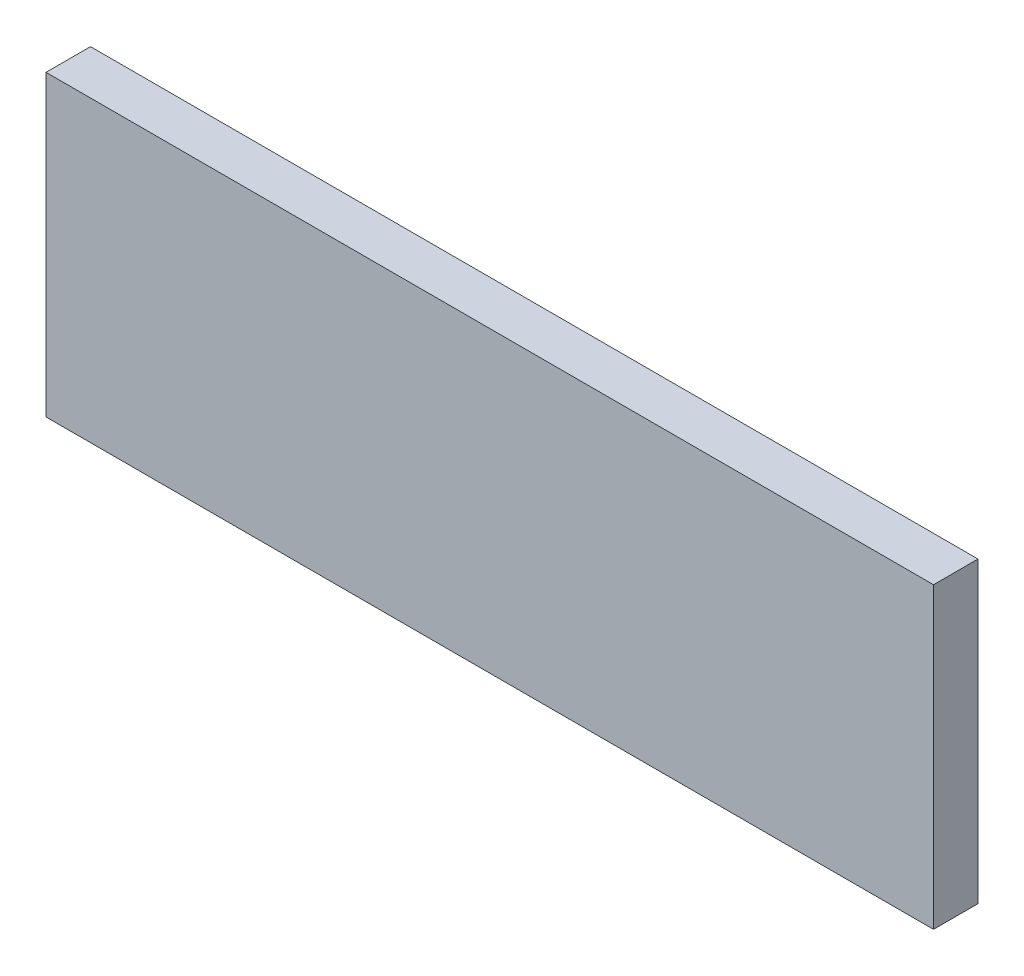
ISO-10303-21;
HEADER;
FILE_DESCRIPTION(('STEP AP214'),'2;1');
FILE_NAME('part.step','',(''),(''),'','','');
FILE_SCHEMA(('AUTOMOTIVE_DESIGN { 1 0 10303 214 1 1 1 1 }'));
ENDSEC;
DATA;
#1=APPLICATION_CONTEXT('core data for automotive mechanical design processes');
#2=APPLICATION_PROTOCOL_DEFINITION('international standard','automotive_design',2000,#1);
#3=PRODUCT_CONTEXT('',#1,'mechanical');
#4=PRODUCT('Part','Part','',(#3));
#5=PRODUCT_RELATED_PRODUCT_CATEGORY('part','',(#4));
#6=PRODUCT_DEFINITION_FORMATION('','',#4);
#7=PRODUCT_DEFINITION_CONTEXT('part definition',#1,'design');
#8=PRODUCT_DEFINITION('design','',#6,#7);
#9=PRODUCT_DEFINITION_SHAPE('','',#8);
#10=(LENGTH_UNIT() NAMED_UNIT(*) SI_UNIT(.MILLI.,.METRE.));
#11=(NAMED_UNIT(*) PLANE_ANGLE_UNIT() SI_UNIT($,.RADIAN.));
#12=(NAMED_UNIT(*) SI_UNIT($,.STERADIAN.) SOLID_ANGLE_UNIT());
#13=UNCERTAINTY_MEASURE_WITH_UNIT(LENGTH_MEASURE(1.E-05),#10,'distance_accuracy_value','');
#14=(GEOMETRIC_REPRESENTATION_CONTEXT(3) GLOBAL_UNCERTAINTY_ASSIGNED_CONTEXT((#13)) GLOBAL_UNIT_ASSIGNED_CONTEXT((#10,
#11,#12)) REPRESENTATION_CONTEXT('',''));
#15=CARTESIAN_POINT('',(0.,0.,0.));
#16=DIRECTION('',(0.,0.,1.));
#17=DIRECTION('',(1.,0.,0.));
#18=AXIS2_PLACEMENT_3D('',#15,#16,#17);
#19=CARTESIAN_POINT('',(-95.,31.95,9.525));
#20=DIRECTION('',(1.,0.,0.));
#21=DIRECTION('',(0.,0.,-1.));
#22=AXIS2_PLACEMENT_3D('',#19,#20,#21);
#23=PLANE('',#22);
#24=DIRECTION('',(0.,-1.,0.));
#25=VECTOR('',#24,1.);
#26=CARTESIAN_POINT('',(-95.,31.95,0.));
#27=LINE('',#26,#25);
#28=CARTESIAN_POINT('',(-95.,31.95,0.));
#29=VERTEX_POINT('',#28);
#30=CARTESIAN_POINT('',(-95.,-31.95,0.));
#31=VERTEX_POINT('',#30);
#32=EDGE_CURVE('E122',#29,#31,#27,.T.);
#33=ORIENTED_EDGE('',*,*,#32,.T.);
#34=DIRECTION('',(0.,0.,-1.));
#35=VECTOR('',#34,1.);
#36=CARTESIAN_POINT('',(-95.,-31.95,9.525));
#37=LINE('',#36,#35);
#38=CARTESIAN_POINT('',(-95.,-31.95,9.525));
#39=VERTEX_POINT('',#38);
#40=EDGE_CURVE('E11',#39,#31,#37,.T.);
#41=ORIENTED_EDGE('',*,*,#40,.F.);
#42=DIRECTION('',(0.,-1.,0.));
#43=VECTOR('',#42,1.);
#44=CARTESIAN_POINT('',(-95.,31.95,9.525));
#45=LINE('',#44,#43);
#46=CARTESIAN_POINT('',(-95.,31.95,9.525));
#47=VERTEX_POINT('',#46);
#48=EDGE_CURVE('E123',#47,#39,#45,.T.);
#49=ORIENTED_EDGE('',*,*,#48,.F.);
#50=DIRECTION('',(0.,0.,-1.));
#51=VECTOR('',#50,1.);
#52=CARTESIAN_POINT('',(-95.,31.95,9.525));
#53=LINE('',#52,#51);
#54=EDGE_CURVE('E129',#47,#29,#53,.T.);
#55=ORIENTED_EDGE('',*,*,#54,.T.);
#56=EDGE_LOOP('',(#33,#41,#49,#55));
#57=FACE_BOUND('',#56,.T.);
#58=ADVANCED_FACE('F38',(#57),#23,.F.);
#59=CARTESIAN_POINT('',(-95.,-31.95,9.525));
#60=DIRECTION('',(0.,1.,0.));
#61=DIRECTION('',(0.,0.,1.));
#62=AXIS2_PLACEMENT_3D('',#59,#60,#61);
#63=PLANE('',#62);
#64=CARTESIAN_POINT('',(71.25,-31.95,4.7625));
#65=DIRECTION('',(0.,-1.,0.));
#66=DIRECTION('',(0.,0.,-1.));
#67=AXIS2_PLACEMENT_3D('',#64,#65,#66);
#68=CIRCLE('',#67,1.64999999999998);
#69=CARTESIAN_POINT('',(71.25,-31.95,3.11250000000002));
#70=VERTEX_POINT('',#69);
#71=EDGE_CURVE('E106',#70,#70,#68,.T.);
#72=ORIENTED_EDGE('',*,*,#71,.F.);
#73=EDGE_LOOP('',(#72));
#74=FACE_BOUND('',#73,.T.);
#75=CARTESIAN_POINT('',(0.,-31.95,4.7625));
#76=DIRECTION('',(0.,-1.,0.));
#77=DIRECTION('',(0.,0.,-1.));
#78=AXIS2_PLACEMENT_3D('',#75,#76,#77);
#79=CIRCLE('',#78,1.64999999999999);
#80=CARTESIAN_POINT('',(0.,-31.95,3.11250000000001));
#81=VERTEX_POINT('',#80);
#82=EDGE_CURVE('E105',#81,#81,#79,.T.);
#83=ORIENTED_EDGE('',*,*,#82,.F.);
#84=EDGE_LOOP('',(#83));
#85=FACE_BOUND('',#84,.T.);
#86=CARTESIAN_POINT('',(-71.25,-31.95,4.7625));
#87=DIRECTION('',(0.,-1.,0.));
#88=DIRECTION('',(0.,0.,-1.));
#89=AXIS2_PLACEMENT_3D('',#86,#87,#88);
#90=CIRCLE('',#89,1.64999999999998);
#91=CARTESIAN_POINT('',(-71.25,-31.95,3.11250000000002));
#92=VERTEX_POINT('',#91);
#93=EDGE_CURVE('E116',#92,#92,#90,.T.);
#94=ORIENTED_EDGE('',*,*,#93,.F.);
#95=EDGE_LOOP('',(#94));
#96=FACE_BOUND('',#95,.T.);
#97=DIRECTION('',(1.,0.,0.));
#98=VECTOR('',#97,1.);
#99=CARTESIAN_POINT('',(-95.,-31.95,0.));
#100=LINE('',#99,#98);
#101=CARTESIAN_POINT('',(95.,-31.95,0.));
#102=VERTEX_POINT('',#101);
#103=EDGE_CURVE('E132',#31,#102,#100,.T.);
#104=ORIENTED_EDGE('',*,*,#103,.T.);
#105=DIRECTION('',(0.,0.,-1.));
#106=VECTOR('',#105,1.);
#107=CARTESIAN_POINT('',(95.,-31.95,9.525));
#108=LINE('',#107,#106);
#109=CARTESIAN_POINT('',(95.,-31.95,9.525));
#110=VERTEX_POINT('',#109);
#111=EDGE_CURVE('E46',#110,#102,#108,.T.);
#112=ORIENTED_EDGE('',*,*,#111,.F.);
#113=DIRECTION('',(1.,0.,0.));
#114=VECTOR('',#113,1.);
#115=CARTESIAN_POINT('',(-95.,-31.95,9.525));
#116=LINE('',#115,#114);
#117=EDGE_CURVE('E85',#39,#110,#116,.T.);
#118=ORIENTED_EDGE('',*,*,#117,.F.);
#119=ORIENTED_EDGE('',*,*,#40,.T.);
#120=EDGE_LOOP('',(#104,#112,#118,#119));
#121=FACE_BOUND('',#120,.T.);
#122=ADVANCED_FACE('F155',(#74,#85,#96,#121),#63,.F.);
#123=CARTESIAN_POINT('',(95.,31.95,9.525));
#124=DIRECTION('',(-1.,0.,0.));
#125=DIRECTION('',(0.,0.,1.));
#126=AXIS2_PLACEMENT_3D('',#123,#124,#125);
#127=PLANE('',#126);
#128=DIRECTION('',(0.,1.,0.));
#129=VECTOR('',#128,1.);
#130=CARTESIAN_POINT('',(95.,31.95,0.));
#131=LINE('',#130,#129);
#132=CARTESIAN_POINT('',(95.,31.95,0.));
#133=VERTEX_POINT('',#132);
#134=EDGE_CURVE('E72',#102,#133,#131,.T.);
#135=ORIENTED_EDGE('',*,*,#134,.T.);
#136=DIRECTION('',(0.,0.,-1.));
#137=VECTOR('',#136,1.);
#138=CARTESIAN_POINT('',(95.,31.95,9.525));
#139=LINE('',#138,#137);
#140=CARTESIAN_POINT('',(95.,31.95,9.525));
#141=VERTEX_POINT('',#140);
#142=EDGE_CURVE('E137',#141,#133,#139,.T.);
#143=ORIENTED_EDGE('',*,*,#142,.F.);
#144=DIRECTION('',(0.,1.,0.));
#145=VECTOR('',#144,1.);
#146=CARTESIAN_POINT('',(95.,31.95,9.525));
#147=LINE('',#146,#145);
#148=EDGE_CURVE('E126',#110,#141,#147,.T.);
#149=ORIENTED_EDGE('',*,*,#148,.F.);
#150=ORIENTED_EDGE('',*,*,#111,.T.);
#151=EDGE_LOOP('',(#135,#143,#149,#150));
#152=FACE_BOUND('',#151,.T.);
#153=ADVANCED_FACE('F139',(#152),#127,.F.);
#154=CARTESIAN_POINT('',(-95.,31.95,9.525));
#155=DIRECTION('',(0.,-1.,0.));
#156=DIRECTION('',(0.,0.,-1.));
#157=AXIS2_PLACEMENT_3D('',#154,#155,#156);
#158=PLANE('',#157);
#159=DIRECTION('',(-1.,0.,0.));
#160=VECTOR('',#159,1.);
#161=CARTESIAN_POINT('',(-95.,31.95,0.));
#162=LINE('',#161,#160);
#163=EDGE_CURVE('E78',#133,#29,#162,.T.);
#164=ORIENTED_EDGE('',*,*,#163,.T.);
#165=ORIENTED_EDGE('',*,*,#54,.F.);
#166=DIRECTION('',(-1.,0.,0.));
#167=VECTOR('',#166,1.);
#168=CARTESIAN_POINT('',(-95.,31.95,9.525));
#169=LINE('',#168,#167);
#170=EDGE_CURVE('E54',#141,#47,#169,.T.);
#171=ORIENTED_EDGE('',*,*,#170,.F.);
#172=ORIENTED_EDGE('',*,*,#142,.T.);
#173=EDGE_LOOP('',(#164,#165,#171,#172));
#174=FACE_BOUND('',#173,.T.);
#175=ADVANCED_FACE('F146',(#174),#158,.F.);
#176=CARTESIAN_POINT('',(0.,0.,9.525));
#177=DIRECTION('',(0.,0.,1.));
#178=DIRECTION('',(1.,0.,0.));
#179=AXIS2_PLACEMENT_3D('',#176,#177,#178);
#180=PLANE('',#179);
#181=ORIENTED_EDGE('',*,*,#48,.T.);
#182=ORIENTED_EDGE('',*,*,#117,.T.);
#183=ORIENTED_EDGE('',*,*,#148,.T.);
#184=ORIENTED_EDGE('',*,*,#170,.T.);
#185=EDGE_LOOP('',(#181,#182,#183,#184));
#186=FACE_BOUND('',#185,.T.);
#187=ADVANCED_FACE('F148',(#186),#180,.T.);
#188=CARTESIAN_POINT('',(0.,0.,0.));
#189=DIRECTION('',(0.,0.,1.));
#190=DIRECTION('',(1.,0.,0.));
#191=AXIS2_PLACEMENT_3D('',#188,#189,#190);
#192=PLANE('',#191);
#193=ORIENTED_EDGE('',*,*,#32,.F.);
#194=ORIENTED_EDGE('',*,*,#163,.F.);
#195=ORIENTED_EDGE('',*,*,#134,.F.);
#196=ORIENTED_EDGE('',*,*,#103,.F.);
#197=EDGE_LOOP('',(#193,#194,#195,#196));
#198=FACE_BOUND('',#197,.T.);
#199=ADVANCED_FACE('F142',(#198),#192,.F.);
#200=CARTESIAN_POINT('',(-71.25,-19.25,4.7625));
#201=DIRECTION('',(0.,-1.,0.));
#202=DIRECTION('',(0.,0.,-1.));
#203=AXIS2_PLACEMENT_3D('',#200,#201,#202);
#204=CONICAL_SURFACE('',#203,1.64999999999998,1.02974425867665);
#205=CARTESIAN_POINT('',(-71.25,-18.2585799786045,4.7625));
#206=VERTEX_POINT('',#205);
#207=VERTEX_LOOP('',#206);
#208=FACE_BOUND('',#207,.T.);
#209=CARTESIAN_POINT('',(-71.25,-19.25,4.7625));
#210=DIRECTION('',(0.,-1.,0.));
#211=DIRECTION('',(0.,0.,-1.));
#212=AXIS2_PLACEMENT_3D('',#209,#210,#211);
#213=CIRCLE('',#212,1.64999999999998);
#214=CARTESIAN_POINT('',(-71.25,-19.25,3.11250000000002));
#215=VERTEX_POINT('',#214);
#216=EDGE_CURVE('E119',#215,#215,#213,.T.);
#217=ORIENTED_EDGE('',*,*,#216,.T.);
#218=EDGE_LOOP('',(#217));
#219=FACE_BOUND('',#218,.T.);
#220=ADVANCED_FACE('F174',(#208,#219),#204,.F.);
#221=CARTESIAN_POINT('',(-71.25,-31.95,4.7625));
#222=DIRECTION('',(0.,-1.,0.));
#223=DIRECTION('',(0.,0.,-1.));
#224=AXIS2_PLACEMENT_3D('',#221,#222,#223);
#225=CYLINDRICAL_SURFACE('',#224,1.64999999999998);
#226=ORIENTED_EDGE('',*,*,#216,.F.);
#227=EDGE_LOOP('',(#226));
#228=FACE_BOUND('',#227,.T.);
#229=ORIENTED_EDGE('',*,*,#93,.T.);
#230=EDGE_LOOP('',(#229));
#231=FACE_BOUND('',#230,.T.);
#232=ADVANCED_FACE('F171',(#228,#231),#225,.F.);
#233=CARTESIAN_POINT('',(0.,-19.25,4.7625));
#234=DIRECTION('',(0.,-1.,0.));
#235=DIRECTION('',(0.,0.,-1.));
#236=AXIS2_PLACEMENT_3D('',#233,#234,#235);
#237=CONICAL_SURFACE('',#236,1.64999999999999,1.02974425867665);
#238=CARTESIAN_POINT('',(0.,-18.2585799786045,4.7625));
#239=VERTEX_POINT('',#238);
#240=VERTEX_LOOP('',#239);
#241=FACE_BOUND('',#240,.T.);
#242=CARTESIAN_POINT('',(0.,-19.25,4.7625));
#243=DIRECTION('',(0.,-1.,0.));
#244=DIRECTION('',(0.,0.,-1.));
#245=AXIS2_PLACEMENT_3D('',#242,#243,#244);
#246=CIRCLE('',#245,1.64999999999999);
#247=CARTESIAN_POINT('',(0.,-19.25,3.11250000000001));
#248=VERTEX_POINT('',#247);
#249=EDGE_CURVE('E109',#248,#248,#246,.T.);
#250=ORIENTED_EDGE('',*,*,#249,.T.);
#251=EDGE_LOOP('',(#250));
#252=FACE_BOUND('',#251,.T.);
#253=ADVANCED_FACE('F173',(#241,#252),#237,.F.);
#254=CARTESIAN_POINT('',(0.,-31.95,4.7625));
#255=DIRECTION('',(0.,-1.,0.));
#256=DIRECTION('',(0.,0.,-1.));
#257=AXIS2_PLACEMENT_3D('',#254,#255,#256);
#258=CYLINDRICAL_SURFACE('',#257,1.64999999999999);
#259=ORIENTED_EDGE('',*,*,#249,.F.);
#260=EDGE_LOOP('',(#259));
#261=FACE_BOUND('',#260,.T.);
#262=ORIENTED_EDGE('',*,*,#82,.T.);
#263=EDGE_LOOP('',(#262));
#264=FACE_BOUND('',#263,.T.);
#265=ADVANCED_FACE('F99',(#261,#264),#258,.F.);
#266=CARTESIAN_POINT('',(71.25,-19.25,4.7625));
#267=DIRECTION('',(0.,-1.,0.));
#268=DIRECTION('',(0.,0.,-1.));
#269=AXIS2_PLACEMENT_3D('',#266,#267,#268);
#270=CONICAL_SURFACE('',#269,1.64999999999998,1.02974425867665);
#271=CARTESIAN_POINT('',(71.25,-18.2585799786045,4.7625));
#272=VERTEX_POINT('',#271);
#273=VERTEX_LOOP('',#272);
#274=FACE_BOUND('',#273,.T.);
#275=CARTESIAN_POINT('',(71.25,-19.25,4.7625));
#276=DIRECTION('',(0.,-1.,0.));
#277=DIRECTION('',(0.,0.,-1.));
#278=AXIS2_PLACEMENT_3D('',#275,#276,#277);
#279=CIRCLE('',#278,1.64999999999998);
#280=CARTESIAN_POINT('',(71.25,-19.25,3.11250000000002));
#281=VERTEX_POINT('',#280);
#282=EDGE_CURVE('E103',#281,#281,#279,.T.);
#283=ORIENTED_EDGE('',*,*,#282,.T.);
#284=EDGE_LOOP('',(#283));
#285=FACE_BOUND('',#284,.T.);
#286=ADVANCED_FACE('F95',(#274,#285),#270,.F.);
#287=CARTESIAN_POINT('',(71.25,-31.95,4.7625));
#288=DIRECTION('',(0.,-1.,0.));
#289=DIRECTION('',(0.,0.,-1.));
#290=AXIS2_PLACEMENT_3D('',#287,#288,#289);
#291=CYLINDRICAL_SURFACE('',#290,1.64999999999998);
#292=ORIENTED_EDGE('',*,*,#282,.F.);
#293=EDGE_LOOP('',(#292));
#294=FACE_BOUND('',#293,.T.);
#295=ORIENTED_EDGE('',*,*,#71,.T.);
#296=EDGE_LOOP('',(#295));
#297=FACE_BOUND('',#296,.T.);
#298=ADVANCED_FACE('F98',(#294,#297),#291,.F.);
#299=CLOSED_SHELL('',(#58,#122,#153,#175,#187,#199,#220,#232,#253,#265,#286,#298));
#300=MANIFOLD_SOLID_BREP('B2',#299);
#301=ADVANCED_BREP_SHAPE_REPRESENTATION('',(#18,#300),#14);
#302=SHAPE_DEFINITION_REPRESENTATION(#9,#301);
ENDSEC;
END-ISO-10303-21;
